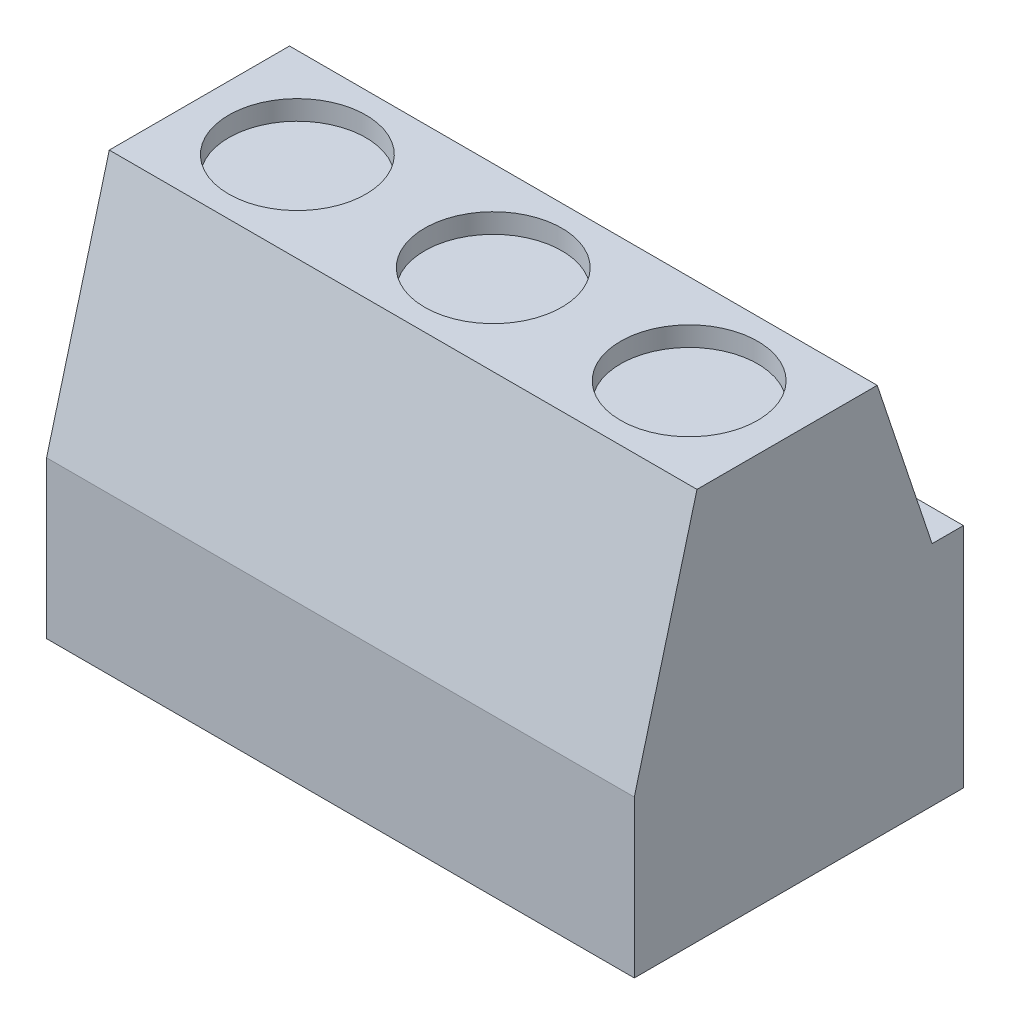
ISO-10303-21;
HEADER;
FILE_DESCRIPTION(('STEP AP214'),'2;1');
FILE_NAME('part.step','',(''),(''),'','','');
FILE_SCHEMA(('AUTOMOTIVE_DESIGN { 1 0 10303 214 1 1 1 1 }'));
ENDSEC;
DATA;
#1=APPLICATION_CONTEXT('core data for automotive mechanical design processes');
#2=APPLICATION_PROTOCOL_DEFINITION('international standard','automotive_design',2000,#1);
#3=PRODUCT_CONTEXT('',#1,'mechanical');
#4=PRODUCT('Part','Part','',(#3));
#5=PRODUCT_RELATED_PRODUCT_CATEGORY('part','',(#4));
#6=PRODUCT_DEFINITION_FORMATION('','',#4);
#7=PRODUCT_DEFINITION_CONTEXT('part definition',#1,'design');
#8=PRODUCT_DEFINITION('design','',#6,#7);
#9=PRODUCT_DEFINITION_SHAPE('','',#8);
#10=(LENGTH_UNIT() NAMED_UNIT(*) SI_UNIT(.MILLI.,.METRE.));
#11=(NAMED_UNIT(*) PLANE_ANGLE_UNIT() SI_UNIT($,.RADIAN.));
#12=(NAMED_UNIT(*) SI_UNIT($,.STERADIAN.) SOLID_ANGLE_UNIT());
#13=UNCERTAINTY_MEASURE_WITH_UNIT(LENGTH_MEASURE(1.E-05),#10,'distance_accuracy_value','');
#14=(GEOMETRIC_REPRESENTATION_CONTEXT(3) GLOBAL_UNCERTAINTY_ASSIGNED_CONTEXT((#13)) GLOBAL_UNIT_ASSIGNED_CONTEXT((#10,
#11,#12)) REPRESENTATION_CONTEXT('',''));
#15=CARTESIAN_POINT('',(0.,0.,0.));
#16=DIRECTION('',(0.,0.,1.));
#17=DIRECTION('',(1.,0.,0.));
#18=AXIS2_PLACEMENT_3D('',#15,#16,#17);
#19=CARTESIAN_POINT('',(-7.5,10.,-4.2));
#20=DIRECTION('',(1.,0.,0.));
#21=DIRECTION('',(0.,0.,-1.));
#22=AXIS2_PLACEMENT_3D('',#19,#20,#21);
#23=PLANE('',#22);
#24=DIRECTION('',(0.,0.,1.));
#25=VECTOR('',#24,1.);
#26=CARTESIAN_POINT('',(-7.5,10.,-4.2));
#27=LINE('',#26,#25);
#28=CARTESIAN_POINT('',(-7.5,10.,-2.));
#29=VERTEX_POINT('',#28);
#30=CARTESIAN_POINT('',(-7.5,10.,2.6));
#31=VERTEX_POINT('',#30);
#32=EDGE_CURVE('E310',#29,#31,#27,.T.);
#33=ORIENTED_EDGE('',*,*,#32,.F.);
#34=DIRECTION('',(0.,0.948683298050514,0.316227766016838));
#35=VECTOR('',#34,1.);
#36=CARTESIAN_POINT('',(-7.5,5.8,-3.4));
#37=LINE('',#36,#35);
#38=CARTESIAN_POINT('',(-7.5,5.8,-3.4));
#39=VERTEX_POINT('',#38);
#40=EDGE_CURVE('E286',#39,#29,#37,.T.);
#41=ORIENTED_EDGE('',*,*,#40,.F.);
#42=DIRECTION('',(0.,0.,1.));
#43=VECTOR('',#42,1.);
#44=CARTESIAN_POINT('',(-7.5,5.8,-3.4));
#45=LINE('',#44,#43);
#46=CARTESIAN_POINT('',(-7.5,5.8,-4.2));
#47=VERTEX_POINT('',#46);
#48=EDGE_CURVE('E290',#47,#39,#45,.T.);
#49=ORIENTED_EDGE('',*,*,#48,.F.);
#50=DIRECTION('',(0.,-1.,0.));
#51=VECTOR('',#50,1.);
#52=CARTESIAN_POINT('',(-7.5,10.,-4.2));
#53=LINE('',#52,#51);
#54=CARTESIAN_POINT('',(-7.5,0.,-4.2));
#55=VERTEX_POINT('',#54);
#56=EDGE_CURVE('E317',#47,#55,#53,.T.);
#57=ORIENTED_EDGE('',*,*,#56,.T.);
#58=DIRECTION('',(0.,0.,1.));
#59=VECTOR('',#58,1.);
#60=CARTESIAN_POINT('',(-7.5,0.,-4.2));
#61=LINE('',#60,#59);
#62=CARTESIAN_POINT('',(-7.5,0.,4.20000000000001));
#63=VERTEX_POINT('',#62);
#64=EDGE_CURVE('E298',#55,#63,#61,.T.);
#65=ORIENTED_EDGE('',*,*,#64,.T.);
#66=DIRECTION('',(0.,-1.,0.));
#67=VECTOR('',#66,1.);
#68=CARTESIAN_POINT('',(-7.5,10.,4.20000000000001));
#69=LINE('',#68,#67);
#70=CARTESIAN_POINT('',(-7.5,4.,4.20000000000001));
#71=VERTEX_POINT('',#70);
#72=EDGE_CURVE('E11',#71,#63,#69,.T.);
#73=ORIENTED_EDGE('',*,*,#72,.F.);
#74=DIRECTION('',(0.,-0.966234939601246,0.257662650560332));
#75=VECTOR('',#74,1.);
#76=CARTESIAN_POINT('',(-7.5,10.,2.6));
#77=LINE('',#76,#75);
#78=EDGE_CURVE('E279',#31,#71,#77,.T.);
#79=ORIENTED_EDGE('',*,*,#78,.F.);
#80=EDGE_LOOP('',(#33,#41,#49,#57,#65,#73,#79));
#81=FACE_BOUND('',#80,.T.);
#82=ADVANCED_FACE('F34',(#81),#23,.F.);
#83=CARTESIAN_POINT('',(-7.5,10.,4.20000000000001));
#84=DIRECTION('',(0.,0.,-1.));
#85=DIRECTION('',(-1.,0.,0.));
#86=AXIS2_PLACEMENT_3D('',#83,#84,#85);
#87=PLANE('',#86);
#88=DIRECTION('',(0.,-1.,0.));
#89=VECTOR('',#88,1.);
#90=CARTESIAN_POINT('',(7.5,10.,4.2));
#91=LINE('',#90,#89);
#92=CARTESIAN_POINT('',(7.5,4.,4.20000000000001));
#93=VERTEX_POINT('',#92);
#94=CARTESIAN_POINT('',(7.5,0.,4.2));
#95=VERTEX_POINT('',#94);
#96=EDGE_CURVE('E41',#93,#95,#91,.T.);
#97=ORIENTED_EDGE('',*,*,#96,.F.);
#98=DIRECTION('',(-1.,0.,0.));
#99=VECTOR('',#98,1.);
#100=CARTESIAN_POINT('',(7.5,4.,4.20000000000001));
#101=LINE('',#100,#99);
#102=EDGE_CURVE('E293',#93,#71,#101,.T.);
#103=ORIENTED_EDGE('',*,*,#102,.T.);
#104=ORIENTED_EDGE('',*,*,#72,.T.);
#105=DIRECTION('',(1.,0.,0.));
#106=VECTOR('',#105,1.);
#107=CARTESIAN_POINT('',(-7.5,0.,4.20000000000001));
#108=LINE('',#107,#106);
#109=EDGE_CURVE('E320',#63,#95,#108,.T.);
#110=ORIENTED_EDGE('',*,*,#109,.T.);
#111=EDGE_LOOP('',(#97,#103,#104,#110));
#112=FACE_BOUND('',#111,.T.);
#113=ADVANCED_FACE('F339',(#112),#87,.F.);
#114=CARTESIAN_POINT('',(7.5,10.,-4.2));
#115=DIRECTION('',(-1.,0.,0.));
#116=DIRECTION('',(0.,0.,1.));
#117=AXIS2_PLACEMENT_3D('',#114,#115,#116);
#118=PLANE('',#117);
#119=DIRECTION('',(0.,0.,1.));
#120=VECTOR('',#119,1.);
#121=CARTESIAN_POINT('',(7.5,5.8,-3.4));
#122=LINE('',#121,#120);
#123=CARTESIAN_POINT('',(7.5,5.8,-4.2));
#124=VERTEX_POINT('',#123);
#125=CARTESIAN_POINT('',(7.5,5.8,-3.4));
#126=VERTEX_POINT('',#125);
#127=EDGE_CURVE('E282',#124,#126,#122,.T.);
#128=ORIENTED_EDGE('',*,*,#127,.T.);
#129=DIRECTION('',(0.,0.948683298050514,0.316227766016838));
#130=VECTOR('',#129,1.);
#131=CARTESIAN_POINT('',(7.5,5.8,-3.4));
#132=LINE('',#131,#130);
#133=CARTESIAN_POINT('',(7.5,10.,-2.));
#134=VERTEX_POINT('',#133);
#135=EDGE_CURVE('E285',#126,#134,#132,.T.);
#136=ORIENTED_EDGE('',*,*,#135,.T.);
#137=DIRECTION('',(0.,0.,-1.));
#138=VECTOR('',#137,1.);
#139=CARTESIAN_POINT('',(7.5,10.,-4.2));
#140=LINE('',#139,#138);
#141=CARTESIAN_POINT('',(7.5,10.,2.6));
#142=VERTEX_POINT('',#141);
#143=EDGE_CURVE('E313',#142,#134,#140,.T.);
#144=ORIENTED_EDGE('',*,*,#143,.F.);
#145=DIRECTION('',(0.,-0.966234939601246,0.257662650560332));
#146=VECTOR('',#145,1.);
#147=CARTESIAN_POINT('',(7.5,10.,2.6));
#148=LINE('',#147,#146);
#149=EDGE_CURVE('E302',#142,#93,#148,.T.);
#150=ORIENTED_EDGE('',*,*,#149,.T.);
#151=ORIENTED_EDGE('',*,*,#96,.T.);
#152=DIRECTION('',(0.,0.,-1.));
#153=VECTOR('',#152,1.);
#154=CARTESIAN_POINT('',(7.5,0.,-4.2));
#155=LINE('',#154,#153);
#156=CARTESIAN_POINT('',(7.5,0.,-4.2));
#157=VERTEX_POINT('',#156);
#158=EDGE_CURVE('E323',#95,#157,#155,.T.);
#159=ORIENTED_EDGE('',*,*,#158,.T.);
#160=DIRECTION('',(0.,-1.,0.));
#161=VECTOR('',#160,1.);
#162=CARTESIAN_POINT('',(7.5,10.,-4.2));
#163=LINE('',#162,#161);
#164=EDGE_CURVE('E329',#124,#157,#163,.T.);
#165=ORIENTED_EDGE('',*,*,#164,.F.);
#166=EDGE_LOOP('',(#128,#136,#144,#150,#151,#159,#165));
#167=FACE_BOUND('',#166,.T.);
#168=ADVANCED_FACE('F332',(#167),#118,.F.);
#169=CARTESIAN_POINT('',(-7.5,10.,-4.2));
#170=DIRECTION('',(0.,0.,1.));
#171=DIRECTION('',(1.,0.,0.));
#172=AXIS2_PLACEMENT_3D('',#169,#170,#171);
#173=PLANE('',#172);
#174=DIRECTION('',(-1.,0.,0.));
#175=VECTOR('',#174,1.);
#176=CARTESIAN_POINT('',(1.5,1.4,-4.2));
#177=LINE('',#176,#175);
#178=CARTESIAN_POINT('',(1.5,1.4,-4.2));
#179=VERTEX_POINT('',#178);
#180=CARTESIAN_POINT('',(-1.5,1.4,-4.2));
#181=VERTEX_POINT('',#180);
#182=EDGE_CURVE('E192',#179,#181,#177,.T.);
#183=ORIENTED_EDGE('',*,*,#182,.F.);
#184=DIRECTION('',(0.,-1.,0.));
#185=VECTOR('',#184,1.);
#186=CARTESIAN_POINT('',(1.5,3.4,-4.2));
#187=LINE('',#186,#185);
#188=CARTESIAN_POINT('',(1.5,3.4,-4.2));
#189=VERTEX_POINT('',#188);
#190=EDGE_CURVE('E48',#189,#179,#187,.T.);
#191=ORIENTED_EDGE('',*,*,#190,.F.);
#192=DIRECTION('',(1.,0.,0.));
#193=VECTOR('',#192,1.);
#194=CARTESIAN_POINT('',(1.5,3.4,-4.2));
#195=LINE('',#194,#193);
#196=CARTESIAN_POINT('',(-1.5,3.4,-4.2));
#197=VERTEX_POINT('',#196);
#198=EDGE_CURVE('E183',#197,#189,#195,.T.);
#199=ORIENTED_EDGE('',*,*,#198,.F.);
#200=DIRECTION('',(0.,1.,0.));
#201=VECTOR('',#200,1.);
#202=CARTESIAN_POINT('',(-1.5,3.4,-4.2));
#203=LINE('',#202,#201);
#204=EDGE_CURVE('E186',#181,#197,#203,.T.);
#205=ORIENTED_EDGE('',*,*,#204,.F.);
#206=EDGE_LOOP('',(#183,#191,#199,#205));
#207=FACE_BOUND('',#206,.T.);
#208=DIRECTION('',(-1.,0.,0.));
#209=VECTOR('',#208,1.);
#210=CARTESIAN_POINT('',(6.5,1.4,-4.2));
#211=LINE('',#210,#209);
#212=CARTESIAN_POINT('',(6.5,1.4,-4.2));
#213=VERTEX_POINT('',#212);
#214=CARTESIAN_POINT('',(3.5,1.4,-4.2));
#215=VERTEX_POINT('',#214);
#216=EDGE_CURVE('E218',#213,#215,#211,.T.);
#217=ORIENTED_EDGE('',*,*,#216,.F.);
#218=DIRECTION('',(0.,-1.,0.));
#219=VECTOR('',#218,1.);
#220=CARTESIAN_POINT('',(6.5,3.4,-4.2));
#221=LINE('',#220,#219);
#222=CARTESIAN_POINT('',(6.5,3.4,-4.2));
#223=VERTEX_POINT('',#222);
#224=EDGE_CURVE('E56',#223,#213,#221,.T.);
#225=ORIENTED_EDGE('',*,*,#224,.F.);
#226=DIRECTION('',(1.,0.,0.));
#227=VECTOR('',#226,1.);
#228=CARTESIAN_POINT('',(6.5,3.4,-4.2));
#229=LINE('',#228,#227);
#230=CARTESIAN_POINT('',(3.5,3.4,-4.2));
#231=VERTEX_POINT('',#230);
#232=EDGE_CURVE('E207',#231,#223,#229,.T.);
#233=ORIENTED_EDGE('',*,*,#232,.F.);
#234=DIRECTION('',(0.,1.,0.));
#235=VECTOR('',#234,1.);
#236=CARTESIAN_POINT('',(3.5,3.4,-4.2));
#237=LINE('',#236,#235);
#238=EDGE_CURVE('E221',#215,#231,#237,.T.);
#239=ORIENTED_EDGE('',*,*,#238,.F.);
#240=EDGE_LOOP('',(#217,#225,#233,#239));
#241=FACE_BOUND('',#240,.T.);
#242=DIRECTION('',(-1.,0.,0.));
#243=VECTOR('',#242,1.);
#244=CARTESIAN_POINT('',(-3.5,1.4,-4.2));
#245=LINE('',#244,#243);
#246=CARTESIAN_POINT('',(-3.5,1.4,-4.2));
#247=VERTEX_POINT('',#246);
#248=CARTESIAN_POINT('',(-6.5,1.4,-4.2));
#249=VERTEX_POINT('',#248);
#250=EDGE_CURVE('E259',#247,#249,#245,.T.);
#251=ORIENTED_EDGE('',*,*,#250,.F.);
#252=DIRECTION('',(0.,-1.,0.));
#253=VECTOR('',#252,1.);
#254=CARTESIAN_POINT('',(-3.5,3.4,-4.2));
#255=LINE('',#254,#253);
#256=CARTESIAN_POINT('',(-3.5,3.4,-4.2));
#257=VERTEX_POINT('',#256);
#258=EDGE_CURVE('E239',#257,#247,#255,.T.);
#259=ORIENTED_EDGE('',*,*,#258,.F.);
#260=DIRECTION('',(1.,0.,0.));
#261=VECTOR('',#260,1.);
#262=CARTESIAN_POINT('',(-3.5,3.4,-4.2));
#263=LINE('',#262,#261);
#264=CARTESIAN_POINT('',(-6.5,3.4,-4.2));
#265=VERTEX_POINT('',#264);
#266=EDGE_CURVE('E248',#265,#257,#263,.T.);
#267=ORIENTED_EDGE('',*,*,#266,.F.);
#268=DIRECTION('',(0.,1.,0.));
#269=VECTOR('',#268,1.);
#270=CARTESIAN_POINT('',(-6.5,3.4,-4.2));
#271=LINE('',#270,#269);
#272=EDGE_CURVE('E262',#249,#265,#271,.T.);
#273=ORIENTED_EDGE('',*,*,#272,.F.);
#274=EDGE_LOOP('',(#251,#259,#267,#273));
#275=FACE_BOUND('',#274,.T.);
#276=ORIENTED_EDGE('',*,*,#56,.F.);
#277=DIRECTION('',(-1.,0.,0.));
#278=VECTOR('',#277,1.);
#279=CARTESIAN_POINT('',(7.5,5.8,-4.2));
#280=LINE('',#279,#278);
#281=EDGE_CURVE('E289',#124,#47,#280,.T.);
#282=ORIENTED_EDGE('',*,*,#281,.F.);
#283=ORIENTED_EDGE('',*,*,#164,.T.);
#284=DIRECTION('',(-1.,0.,0.));
#285=VECTOR('',#284,1.);
#286=CARTESIAN_POINT('',(-7.5,0.,-4.2));
#287=LINE('',#286,#285);
#288=EDGE_CURVE('E314',#157,#55,#287,.T.);
#289=ORIENTED_EDGE('',*,*,#288,.T.);
#290=EDGE_LOOP('',(#276,#282,#283,#289));
#291=FACE_BOUND('',#290,.T.);
#292=ADVANCED_FACE('F346',(#207,#241,#275,#291),#173,.F.);
#293=CARTESIAN_POINT('',(0.,10.,0.));
#294=DIRECTION('',(0.,1.,0.));
#295=DIRECTION('',(0.,0.,1.));
#296=AXIS2_PLACEMENT_3D('',#293,#294,#295);
#297=PLANE('',#296);
#298=CARTESIAN_POINT('',(0.,10.,0.300000000000004));
#299=DIRECTION('',(0.,1.,0.));
#300=DIRECTION('',(0.,0.,1.));
#301=AXIS2_PLACEMENT_3D('',#298,#299,#300);
#302=CIRCLE('',#301,1.75);
#303=CARTESIAN_POINT('',(0.,10.,2.05000000000001));
#304=VERTEX_POINT('',#303);
#305=EDGE_CURVE('E232',#304,#304,#302,.T.);
#306=ORIENTED_EDGE('',*,*,#305,.F.);
#307=EDGE_LOOP('',(#306));
#308=FACE_BOUND('',#307,.T.);
#309=CARTESIAN_POINT('',(5.,10.,0.300000000000002));
#310=DIRECTION('',(0.,1.,0.));
#311=DIRECTION('',(0.,0.,1.));
#312=AXIS2_PLACEMENT_3D('',#309,#310,#311);
#313=CIRCLE('',#312,1.75);
#314=CARTESIAN_POINT('',(5.,10.,2.05000000000001));
#315=VERTEX_POINT('',#314);
#316=EDGE_CURVE('E199',#315,#315,#313,.T.);
#317=ORIENTED_EDGE('',*,*,#316,.F.);
#318=EDGE_LOOP('',(#317));
#319=FACE_BOUND('',#318,.T.);
#320=CARTESIAN_POINT('',(-5.,10.,0.300000000000005));
#321=DIRECTION('',(0.,1.,0.));
#322=DIRECTION('',(0.,0.,1.));
#323=AXIS2_PLACEMENT_3D('',#320,#321,#322);
#324=CIRCLE('',#323,1.75);
#325=CARTESIAN_POINT('',(-5.,10.,2.05000000000001));
#326=VERTEX_POINT('',#325);
#327=EDGE_CURVE('E269',#326,#326,#324,.T.);
#328=ORIENTED_EDGE('',*,*,#327,.F.);
#329=EDGE_LOOP('',(#328));
#330=FACE_BOUND('',#329,.T.);
#331=DIRECTION('',(-1.,0.,0.));
#332=VECTOR('',#331,1.);
#333=CARTESIAN_POINT('',(7.5,10.,-2.));
#334=LINE('',#333,#332);
#335=EDGE_CURVE('E295',#134,#29,#334,.T.);
#336=ORIENTED_EDGE('',*,*,#335,.T.);
#337=ORIENTED_EDGE('',*,*,#32,.T.);
#338=DIRECTION('',(-1.,0.,0.));
#339=VECTOR('',#338,1.);
#340=CARTESIAN_POINT('',(7.5,10.,2.6));
#341=LINE('',#340,#339);
#342=EDGE_CURVE('E305',#142,#31,#341,.T.);
#343=ORIENTED_EDGE('',*,*,#342,.F.);
#344=ORIENTED_EDGE('',*,*,#143,.T.);
#345=EDGE_LOOP('',(#336,#337,#343,#344));
#346=FACE_BOUND('',#345,.T.);
#347=ADVANCED_FACE('F357',(#308,#319,#330,#346),#297,.T.);
#348=CARTESIAN_POINT('',(0.,0.,0.));
#349=DIRECTION('',(0.,1.,0.));
#350=DIRECTION('',(0.,0.,1.));
#351=AXIS2_PLACEMENT_3D('',#348,#349,#350);
#352=PLANE('',#351);
#353=ORIENTED_EDGE('',*,*,#64,.F.);
#354=ORIENTED_EDGE('',*,*,#288,.F.);
#355=ORIENTED_EDGE('',*,*,#158,.F.);
#356=ORIENTED_EDGE('',*,*,#109,.F.);
#357=EDGE_LOOP('',(#353,#354,#355,#356));
#358=FACE_BOUND('',#357,.T.);
#359=ADVANCED_FACE('F343',(#358),#352,.F.);
#360=CARTESIAN_POINT('',(7.5,10.,2.6));
#361=DIRECTION('',(0.,-0.257662650560332,-0.966234939601246));
#362=DIRECTION('',(0.,0.966234939601246,-0.257662650560332));
#363=AXIS2_PLACEMENT_3D('',#360,#361,#362);
#364=PLANE('',#363);
#365=ORIENTED_EDGE('',*,*,#78,.T.);
#366=ORIENTED_EDGE('',*,*,#102,.F.);
#367=ORIENTED_EDGE('',*,*,#149,.F.);
#368=ORIENTED_EDGE('',*,*,#342,.T.);
#369=EDGE_LOOP('',(#365,#366,#367,#368));
#370=FACE_BOUND('',#369,.T.);
#371=ADVANCED_FACE('F362',(#370),#364,.F.);
#372=CARTESIAN_POINT('',(7.5,5.8,-3.4));
#373=DIRECTION('',(0.,-0.316227766016838,0.948683298050514));
#374=DIRECTION('',(0.,-0.948683298050514,-0.316227766016838));
#375=AXIS2_PLACEMENT_3D('',#372,#373,#374);
#376=PLANE('',#375);
#377=ORIENTED_EDGE('',*,*,#40,.T.);
#378=ORIENTED_EDGE('',*,*,#335,.F.);
#379=ORIENTED_EDGE('',*,*,#135,.F.);
#380=DIRECTION('',(-1.,0.,0.));
#381=VECTOR('',#380,1.);
#382=CARTESIAN_POINT('',(7.5,5.8,-3.4));
#383=LINE('',#382,#381);
#384=EDGE_CURVE('E299',#126,#39,#383,.T.);
#385=ORIENTED_EDGE('',*,*,#384,.T.);
#386=EDGE_LOOP('',(#377,#378,#379,#385));
#387=FACE_BOUND('',#386,.T.);
#388=ADVANCED_FACE('F354',(#387),#376,.F.);
#389=CARTESIAN_POINT('',(7.5,5.8,-3.4));
#390=DIRECTION('',(0.,-1.,0.));
#391=DIRECTION('',(0.,0.,-1.));
#392=AXIS2_PLACEMENT_3D('',#389,#390,#391);
#393=PLANE('',#392);
#394=ORIENTED_EDGE('',*,*,#48,.T.);
#395=ORIENTED_EDGE('',*,*,#384,.F.);
#396=ORIENTED_EDGE('',*,*,#127,.F.);
#397=ORIENTED_EDGE('',*,*,#281,.T.);
#398=EDGE_LOOP('',(#394,#395,#396,#397));
#399=FACE_BOUND('',#398,.T.);
#400=ADVANCED_FACE('F350',(#399),#393,.F.);
#401=CARTESIAN_POINT('',(-5.,9.5,0.300000000000005));
#402=DIRECTION('',(0.,1.,0.));
#403=DIRECTION('',(0.,0.,1.));
#404=AXIS2_PLACEMENT_3D('',#401,#402,#403);
#405=CYLINDRICAL_SURFACE('',#404,1.75);
#406=CARTESIAN_POINT('',(-5.,9.5,0.300000000000005));
#407=DIRECTION('',(0.,1.,0.));
#408=DIRECTION('',(0.,0.,1.));
#409=AXIS2_PLACEMENT_3D('',#406,#407,#408);
#410=CIRCLE('',#409,1.75);
#411=CARTESIAN_POINT('',(-5.,9.5,2.05000000000001));
#412=VERTEX_POINT('',#411);
#413=EDGE_CURVE('E276',#412,#412,#410,.T.);
#414=ORIENTED_EDGE('',*,*,#413,.F.);
#415=EDGE_LOOP('',(#414));
#416=FACE_BOUND('',#415,.T.);
#417=ORIENTED_EDGE('',*,*,#327,.T.);
#418=EDGE_LOOP('',(#417));
#419=FACE_BOUND('',#418,.T.);
#420=ADVANCED_FACE('F394',(#416,#419),#405,.F.);
#421=CARTESIAN_POINT('',(-5.,9.5,0.300000000000005));
#422=DIRECTION('',(0.,1.,0.));
#423=DIRECTION('',(0.,0.,1.));
#424=AXIS2_PLACEMENT_3D('',#421,#422,#423);
#425=PLANE('',#424);
#426=ORIENTED_EDGE('',*,*,#413,.T.);
#427=EDGE_LOOP('',(#426));
#428=FACE_BOUND('',#427,.T.);
#429=ADVANCED_FACE('F396',(#428),#425,.T.);
#430=CARTESIAN_POINT('',(-3.5,3.4,-3.7));
#431=DIRECTION('',(1.,0.,0.));
#432=DIRECTION('',(0.,1.,0.));
#433=AXIS2_PLACEMENT_3D('',#430,#431,#432);
#434=PLANE('',#433);
#435=ORIENTED_EDGE('',*,*,#258,.T.);
#436=DIRECTION('',(0.,0.,-1.));
#437=VECTOR('',#436,1.);
#438=CARTESIAN_POINT('',(-3.5,1.4,-3.7));
#439=LINE('',#438,#437);
#440=CARTESIAN_POINT('',(-3.5,1.4,-3.7));
#441=VERTEX_POINT('',#440);
#442=EDGE_CURVE('E257',#441,#247,#439,.T.);
#443=ORIENTED_EDGE('',*,*,#442,.F.);
#444=DIRECTION('',(0.,-1.,0.));
#445=VECTOR('',#444,1.);
#446=CARTESIAN_POINT('',(-3.5,3.4,-3.7));
#447=LINE('',#446,#445);
#448=CARTESIAN_POINT('',(-3.5,3.4,-3.7));
#449=VERTEX_POINT('',#448);
#450=EDGE_CURVE('E244',#449,#441,#447,.T.);
#451=ORIENTED_EDGE('',*,*,#450,.F.);
#452=DIRECTION('',(0.,0.,-1.));
#453=VECTOR('',#452,1.);
#454=CARTESIAN_POINT('',(-3.5,3.4,-3.7));
#455=LINE('',#454,#453);
#456=EDGE_CURVE('E267',#449,#257,#455,.T.);
#457=ORIENTED_EDGE('',*,*,#456,.T.);
#458=EDGE_LOOP('',(#435,#443,#451,#457));
#459=FACE_BOUND('',#458,.T.);
#460=ADVANCED_FACE('F403',(#459),#434,.F.);
#461=CARTESIAN_POINT('',(-3.5,3.4,-3.7));
#462=DIRECTION('',(0.,1.,0.));
#463=DIRECTION('',(-1.,0.,0.));
#464=AXIS2_PLACEMENT_3D('',#461,#462,#463);
#465=PLANE('',#464);
#466=ORIENTED_EDGE('',*,*,#266,.T.);
#467=ORIENTED_EDGE('',*,*,#456,.F.);
#468=DIRECTION('',(1.,0.,0.));
#469=VECTOR('',#468,1.);
#470=CARTESIAN_POINT('',(-3.5,3.4,-3.7));
#471=LINE('',#470,#469);
#472=CARTESIAN_POINT('',(-6.5,3.4,-3.7));
#473=VERTEX_POINT('',#472);
#474=EDGE_CURVE('E254',#473,#449,#471,.T.);
#475=ORIENTED_EDGE('',*,*,#474,.F.);
#476=DIRECTION('',(0.,0.,-1.));
#477=VECTOR('',#476,1.);
#478=CARTESIAN_POINT('',(-6.5,3.4,-3.7));
#479=LINE('',#478,#477);
#480=EDGE_CURVE('E270',#473,#265,#479,.T.);
#481=ORIENTED_EDGE('',*,*,#480,.T.);
#482=EDGE_LOOP('',(#466,#467,#475,#481));
#483=FACE_BOUND('',#482,.T.);
#484=ADVANCED_FACE('F410',(#483),#465,.F.);
#485=CARTESIAN_POINT('',(-6.5,3.4,-3.7));
#486=DIRECTION('',(-1.,0.,0.));
#487=DIRECTION('',(0.,0.,1.));
#488=AXIS2_PLACEMENT_3D('',#485,#486,#487);
#489=PLANE('',#488);
#490=ORIENTED_EDGE('',*,*,#272,.T.);
#491=ORIENTED_EDGE('',*,*,#480,.F.);
#492=DIRECTION('',(0.,1.,0.));
#493=VECTOR('',#492,1.);
#494=CARTESIAN_POINT('',(-6.5,3.4,-3.7));
#495=LINE('',#494,#493);
#496=CARTESIAN_POINT('',(-6.5,1.4,-3.7));
#497=VERTEX_POINT('',#496);
#498=EDGE_CURVE('E251',#497,#473,#495,.T.);
#499=ORIENTED_EDGE('',*,*,#498,.F.);
#500=DIRECTION('',(0.,0.,-1.));
#501=VECTOR('',#500,1.);
#502=CARTESIAN_POINT('',(-6.5,1.4,-3.7));
#503=LINE('',#502,#501);
#504=EDGE_CURVE('E272',#497,#249,#503,.T.);
#505=ORIENTED_EDGE('',*,*,#504,.T.);
#506=EDGE_LOOP('',(#490,#491,#499,#505));
#507=FACE_BOUND('',#506,.T.);
#508=ADVANCED_FACE('F416',(#507),#489,.F.);
#509=CARTESIAN_POINT('',(-3.5,1.4,-3.7));
#510=DIRECTION('',(0.,-1.,0.));
#511=DIRECTION('',(1.,0.,0.));
#512=AXIS2_PLACEMENT_3D('',#509,#510,#511);
#513=PLANE('',#512);
#514=ORIENTED_EDGE('',*,*,#250,.T.);
#515=ORIENTED_EDGE('',*,*,#504,.F.);
#516=DIRECTION('',(-1.,0.,0.));
#517=VECTOR('',#516,1.);
#518=CARTESIAN_POINT('',(-3.5,1.4,-3.7));
#519=LINE('',#518,#517);
#520=EDGE_CURVE('E247',#441,#497,#519,.T.);
#521=ORIENTED_EDGE('',*,*,#520,.F.);
#522=ORIENTED_EDGE('',*,*,#442,.T.);
#523=EDGE_LOOP('',(#514,#515,#521,#522));
#524=FACE_BOUND('',#523,.T.);
#525=ADVANCED_FACE('F412',(#524),#513,.F.);
#526=CARTESIAN_POINT('',(0.,0.,-3.7));
#527=DIRECTION('',(0.,0.,-1.));
#528=DIRECTION('',(-1.,0.,0.));
#529=AXIS2_PLACEMENT_3D('',#526,#527,#528);
#530=PLANE('',#529);
#531=ORIENTED_EDGE('',*,*,#450,.T.);
#532=ORIENTED_EDGE('',*,*,#520,.T.);
#533=ORIENTED_EDGE('',*,*,#498,.T.);
#534=ORIENTED_EDGE('',*,*,#474,.T.);
#535=EDGE_LOOP('',(#531,#532,#533,#534));
#536=FACE_BOUND('',#535,.T.);
#537=ADVANCED_FACE('F415',(#536),#530,.T.);
#538=CARTESIAN_POINT('',(5.,9.5,0.300000000000002));
#539=DIRECTION('',(0.,1.,0.));
#540=DIRECTION('',(0.,0.,1.));
#541=AXIS2_PLACEMENT_3D('',#538,#539,#540);
#542=CYLINDRICAL_SURFACE('',#541,1.75);
#543=CARTESIAN_POINT('',(5.,9.5,0.300000000000002));
#544=DIRECTION('',(0.,1.,0.));
#545=DIRECTION('',(0.,0.,1.));
#546=AXIS2_PLACEMENT_3D('',#543,#544,#545);
#547=CIRCLE('',#546,1.75);
#548=CARTESIAN_POINT('',(5.,9.5,2.05000000000001));
#549=VERTEX_POINT('',#548);
#550=EDGE_CURVE('E236',#549,#549,#547,.T.);
#551=ORIENTED_EDGE('',*,*,#550,.F.);
#552=EDGE_LOOP('',(#551));
#553=FACE_BOUND('',#552,.T.);
#554=ORIENTED_EDGE('',*,*,#316,.T.);
#555=EDGE_LOOP('',(#554));
#556=FACE_BOUND('',#555,.T.);
#557=ADVANCED_FACE('F426',(#553,#556),#542,.F.);
#558=CARTESIAN_POINT('',(5.,9.5,0.300000000000002));
#559=DIRECTION('',(0.,1.,0.));
#560=DIRECTION('',(0.,0.,1.));
#561=AXIS2_PLACEMENT_3D('',#558,#559,#560);
#562=PLANE('',#561);
#563=ORIENTED_EDGE('',*,*,#550,.T.);
#564=EDGE_LOOP('',(#563));
#565=FACE_BOUND('',#564,.T.);
#566=ADVANCED_FACE('F430',(#565),#562,.T.);
#567=CARTESIAN_POINT('',(0.,9.5,0.300000000000004));
#568=DIRECTION('',(0.,1.,0.));
#569=DIRECTION('',(0.,0.,1.));
#570=AXIS2_PLACEMENT_3D('',#567,#568,#569);
#571=CYLINDRICAL_SURFACE('',#570,1.75);
#572=CARTESIAN_POINT('',(0.,9.5,0.300000000000004));
#573=DIRECTION('',(0.,1.,0.));
#574=DIRECTION('',(0.,0.,1.));
#575=AXIS2_PLACEMENT_3D('',#572,#573,#574);
#576=CIRCLE('',#575,1.75);
#577=CARTESIAN_POINT('',(0.,9.5,2.05000000000001));
#578=VERTEX_POINT('',#577);
#579=EDGE_CURVE('E235',#578,#578,#576,.T.);
#580=ORIENTED_EDGE('',*,*,#579,.F.);
#581=EDGE_LOOP('',(#580));
#582=FACE_BOUND('',#581,.T.);
#583=ORIENTED_EDGE('',*,*,#305,.T.);
#584=EDGE_LOOP('',(#583));
#585=FACE_BOUND('',#584,.T.);
#586=ADVANCED_FACE('F434',(#582,#585),#571,.F.);
#587=CARTESIAN_POINT('',(0.,9.5,0.300000000000004));
#588=DIRECTION('',(0.,1.,0.));
#589=DIRECTION('',(0.,0.,1.));
#590=AXIS2_PLACEMENT_3D('',#587,#588,#589);
#591=PLANE('',#590);
#592=ORIENTED_EDGE('',*,*,#579,.T.);
#593=EDGE_LOOP('',(#592));
#594=FACE_BOUND('',#593,.T.);
#595=ADVANCED_FACE('F438',(#594),#591,.T.);
#596=CARTESIAN_POINT('',(6.5,3.4,-3.7));
#597=DIRECTION('',(1.,0.,0.));
#598=DIRECTION('',(0.,1.,0.));
#599=AXIS2_PLACEMENT_3D('',#596,#597,#598);
#600=PLANE('',#599);
#601=ORIENTED_EDGE('',*,*,#224,.T.);
#602=DIRECTION('',(0.,0.,-1.));
#603=VECTOR('',#602,1.);
#604=CARTESIAN_POINT('',(6.5,1.4,-3.7));
#605=LINE('',#604,#603);
#606=CARTESIAN_POINT('',(6.5,1.4,-3.7));
#607=VERTEX_POINT('',#606);
#608=EDGE_CURVE('E216',#607,#213,#605,.T.);
#609=ORIENTED_EDGE('',*,*,#608,.F.);
#610=DIRECTION('',(0.,-1.,0.));
#611=VECTOR('',#610,1.);
#612=CARTESIAN_POINT('',(6.5,3.4,-3.7));
#613=LINE('',#612,#611);
#614=CARTESIAN_POINT('',(6.5,3.4,-3.7));
#615=VERTEX_POINT('',#614);
#616=EDGE_CURVE('E203',#615,#607,#613,.T.);
#617=ORIENTED_EDGE('',*,*,#616,.F.);
#618=DIRECTION('',(0.,0.,-1.));
#619=VECTOR('',#618,1.);
#620=CARTESIAN_POINT('',(6.5,3.4,-3.7));
#621=LINE('',#620,#619);
#622=EDGE_CURVE('E193',#615,#223,#621,.T.);
#623=ORIENTED_EDGE('',*,*,#622,.T.);
#624=EDGE_LOOP('',(#601,#609,#617,#623));
#625=FACE_BOUND('',#624,.T.);
#626=ADVANCED_FACE('F442',(#625),#600,.F.);
#627=CARTESIAN_POINT('',(6.5,3.4,-3.7));
#628=DIRECTION('',(0.,1.,0.));
#629=DIRECTION('',(-1.,0.,0.));
#630=AXIS2_PLACEMENT_3D('',#627,#628,#629);
#631=PLANE('',#630);
#632=ORIENTED_EDGE('',*,*,#232,.T.);
#633=ORIENTED_EDGE('',*,*,#622,.F.);
#634=DIRECTION('',(1.,0.,0.));
#635=VECTOR('',#634,1.);
#636=CARTESIAN_POINT('',(6.5,3.4,-3.7));
#637=LINE('',#636,#635);
#638=CARTESIAN_POINT('',(3.5,3.4,-3.7));
#639=VERTEX_POINT('',#638);
#640=EDGE_CURVE('E213',#639,#615,#637,.T.);
#641=ORIENTED_EDGE('',*,*,#640,.F.);
#642=DIRECTION('',(0.,0.,-1.));
#643=VECTOR('',#642,1.);
#644=CARTESIAN_POINT('',(3.5,3.4,-3.7));
#645=LINE('',#644,#643);
#646=EDGE_CURVE('E227',#639,#231,#645,.T.);
#647=ORIENTED_EDGE('',*,*,#646,.T.);
#648=EDGE_LOOP('',(#632,#633,#641,#647));
#649=FACE_BOUND('',#648,.T.);
#650=ADVANCED_FACE('F446',(#649),#631,.F.);
#651=CARTESIAN_POINT('',(3.5,3.4,-3.7));
#652=DIRECTION('',(-1.,0.,0.));
#653=DIRECTION('',(0.,0.,1.));
#654=AXIS2_PLACEMENT_3D('',#651,#652,#653);
#655=PLANE('',#654);
#656=ORIENTED_EDGE('',*,*,#238,.T.);
#657=ORIENTED_EDGE('',*,*,#646,.F.);
#658=DIRECTION('',(0.,1.,0.));
#659=VECTOR('',#658,1.);
#660=CARTESIAN_POINT('',(3.5,3.4,-3.7));
#661=LINE('',#660,#659);
#662=CARTESIAN_POINT('',(3.5,1.4,-3.7));
#663=VERTEX_POINT('',#662);
#664=EDGE_CURVE('E210',#663,#639,#661,.T.);
#665=ORIENTED_EDGE('',*,*,#664,.F.);
#666=DIRECTION('',(0.,0.,-1.));
#667=VECTOR('',#666,1.);
#668=CARTESIAN_POINT('',(3.5,1.4,-3.7));
#669=LINE('',#668,#667);
#670=EDGE_CURVE('E229',#663,#215,#669,.T.);
#671=ORIENTED_EDGE('',*,*,#670,.T.);
#672=EDGE_LOOP('',(#656,#657,#665,#671));
#673=FACE_BOUND('',#672,.T.);
#674=ADVANCED_FACE('F451',(#673),#655,.F.);
#675=CARTESIAN_POINT('',(6.5,1.4,-3.7));
#676=DIRECTION('',(0.,-1.,0.));
#677=DIRECTION('',(1.,0.,0.));
#678=AXIS2_PLACEMENT_3D('',#675,#676,#677);
#679=PLANE('',#678);
#680=ORIENTED_EDGE('',*,*,#216,.T.);
#681=ORIENTED_EDGE('',*,*,#670,.F.);
#682=DIRECTION('',(-1.,0.,0.));
#683=VECTOR('',#682,1.);
#684=CARTESIAN_POINT('',(6.5,1.4,-3.7));
#685=LINE('',#684,#683);
#686=EDGE_CURVE('E206',#607,#663,#685,.T.);
#687=ORIENTED_EDGE('',*,*,#686,.F.);
#688=ORIENTED_EDGE('',*,*,#608,.T.);
#689=EDGE_LOOP('',(#680,#681,#687,#688));
#690=FACE_BOUND('',#689,.T.);
#691=ADVANCED_FACE('F447',(#690),#679,.F.);
#692=CARTESIAN_POINT('',(10.,0.,-3.7));
#693=DIRECTION('',(0.,0.,-1.));
#694=DIRECTION('',(-1.,0.,0.));
#695=AXIS2_PLACEMENT_3D('',#692,#693,#694);
#696=PLANE('',#695);
#697=ORIENTED_EDGE('',*,*,#616,.T.);
#698=ORIENTED_EDGE('',*,*,#686,.T.);
#699=ORIENTED_EDGE('',*,*,#664,.T.);
#700=ORIENTED_EDGE('',*,*,#640,.T.);
#701=EDGE_LOOP('',(#697,#698,#699,#700));
#702=FACE_BOUND('',#701,.T.);
#703=ADVANCED_FACE('F450',(#702),#696,.T.);
#704=CARTESIAN_POINT('',(1.5,3.4,-3.7));
#705=DIRECTION('',(1.,0.,0.));
#706=DIRECTION('',(0.,1.,0.));
#707=AXIS2_PLACEMENT_3D('',#704,#705,#706);
#708=PLANE('',#707);
#709=ORIENTED_EDGE('',*,*,#190,.T.);
#710=DIRECTION('',(0.,0.,-1.));
#711=VECTOR('',#710,1.);
#712=CARTESIAN_POINT('',(1.5,1.4,-3.7));
#713=LINE('',#712,#711);
#714=CARTESIAN_POINT('',(1.5,1.4,-3.7));
#715=VERTEX_POINT('',#714);
#716=EDGE_CURVE('E161',#715,#179,#713,.T.);
#717=ORIENTED_EDGE('',*,*,#716,.F.);
#718=DIRECTION('',(0.,-1.,0.));
#719=VECTOR('',#718,1.);
#720=CARTESIAN_POINT('',(1.5,3.4,-3.7));
#721=LINE('',#720,#719);
#722=CARTESIAN_POINT('',(1.5,3.4,-3.7));
#723=VERTEX_POINT('',#722);
#724=EDGE_CURVE('E165',#723,#715,#721,.T.);
#725=ORIENTED_EDGE('',*,*,#724,.F.);
#726=DIRECTION('',(0.,0.,-1.));
#727=VECTOR('',#726,1.);
#728=CARTESIAN_POINT('',(1.5,3.4,-3.7));
#729=LINE('',#728,#727);
#730=EDGE_CURVE('E197',#723,#189,#729,.T.);
#731=ORIENTED_EDGE('',*,*,#730,.T.);
#732=EDGE_LOOP('',(#709,#717,#725,#731));
#733=FACE_BOUND('',#732,.T.);
#734=ADVANCED_FACE('F163',(#733),#708,.F.);
#735=CARTESIAN_POINT('',(1.5,3.4,-3.7));
#736=DIRECTION('',(0.,1.,0.));
#737=DIRECTION('',(-1.,0.,0.));
#738=AXIS2_PLACEMENT_3D('',#735,#736,#737);
#739=PLANE('',#738);
#740=ORIENTED_EDGE('',*,*,#198,.T.);
#741=ORIENTED_EDGE('',*,*,#730,.F.);
#742=DIRECTION('',(1.,0.,0.));
#743=VECTOR('',#742,1.);
#744=CARTESIAN_POINT('',(1.5,3.4,-3.7));
#745=LINE('',#744,#743);
#746=CARTESIAN_POINT('',(-1.5,3.4,-3.7));
#747=VERTEX_POINT('',#746);
#748=EDGE_CURVE('E171',#747,#723,#745,.T.);
#749=ORIENTED_EDGE('',*,*,#748,.F.);
#750=DIRECTION('',(0.,0.,-1.));
#751=VECTOR('',#750,1.);
#752=CARTESIAN_POINT('',(-1.5,3.4,-3.7));
#753=LINE('',#752,#751);
#754=EDGE_CURVE('E200',#747,#197,#753,.T.);
#755=ORIENTED_EDGE('',*,*,#754,.T.);
#756=EDGE_LOOP('',(#740,#741,#749,#755));
#757=FACE_BOUND('',#756,.T.);
#758=ADVANCED_FACE('F464',(#757),#739,.F.);
#759=CARTESIAN_POINT('',(-1.5,3.4,-3.7));
#760=DIRECTION('',(-1.,0.,0.));
#761=DIRECTION('',(0.,0.,1.));
#762=AXIS2_PLACEMENT_3D('',#759,#760,#761);
#763=PLANE('',#762);
#764=ORIENTED_EDGE('',*,*,#204,.T.);
#765=ORIENTED_EDGE('',*,*,#754,.F.);
#766=DIRECTION('',(0.,1.,0.));
#767=VECTOR('',#766,1.);
#768=CARTESIAN_POINT('',(-1.5,3.4,-3.7));
#769=LINE('',#768,#767);
#770=CARTESIAN_POINT('',(-1.5,1.4,-3.7));
#771=VERTEX_POINT('',#770);
#772=EDGE_CURVE('E179',#771,#747,#769,.T.);
#773=ORIENTED_EDGE('',*,*,#772,.F.);
#774=DIRECTION('',(0.,0.,-1.));
#775=VECTOR('',#774,1.);
#776=CARTESIAN_POINT('',(-1.5,1.4,-3.7));
#777=LINE('',#776,#775);
#778=EDGE_CURVE('E170',#771,#181,#777,.T.);
#779=ORIENTED_EDGE('',*,*,#778,.T.);
#780=EDGE_LOOP('',(#764,#765,#773,#779));
#781=FACE_BOUND('',#780,.T.);
#782=ADVANCED_FACE('F467',(#781),#763,.F.);
#783=CARTESIAN_POINT('',(1.5,1.4,-3.7));
#784=DIRECTION('',(0.,-1.,0.));
#785=DIRECTION('',(1.,0.,0.));
#786=AXIS2_PLACEMENT_3D('',#783,#784,#785);
#787=PLANE('',#786);
#788=ORIENTED_EDGE('',*,*,#182,.T.);
#789=ORIENTED_EDGE('',*,*,#778,.F.);
#790=DIRECTION('',(-1.,0.,0.));
#791=VECTOR('',#790,1.);
#792=CARTESIAN_POINT('',(1.5,1.4,-3.7));
#793=LINE('',#792,#791);
#794=EDGE_CURVE('E174',#715,#771,#793,.T.);
#795=ORIENTED_EDGE('',*,*,#794,.F.);
#796=ORIENTED_EDGE('',*,*,#716,.T.);
#797=EDGE_LOOP('',(#788,#789,#795,#796));
#798=FACE_BOUND('',#797,.T.);
#799=ADVANCED_FACE('F175',(#798),#787,.F.);
#800=CARTESIAN_POINT('',(5.,0.,-3.7));
#801=DIRECTION('',(0.,0.,-1.));
#802=DIRECTION('',(-1.,0.,0.));
#803=AXIS2_PLACEMENT_3D('',#800,#801,#802);
#804=PLANE('',#803);
#805=ORIENTED_EDGE('',*,*,#724,.T.);
#806=ORIENTED_EDGE('',*,*,#794,.T.);
#807=ORIENTED_EDGE('',*,*,#772,.T.);
#808=ORIENTED_EDGE('',*,*,#748,.T.);
#809=EDGE_LOOP('',(#805,#806,#807,#808));
#810=FACE_BOUND('',#809,.T.);
#811=ADVANCED_FACE('F181',(#810),#804,.T.);
#812=CLOSED_SHELL('',(#82,#113,#168,#292,#347,#359,#371,#388,#400,#420,#429,#460,#484,#508,#525,
#537,#557,#566,#586,#595,#626,#650,#674,#691,#703,#734,#758,#782,#799,#811));
#813=MANIFOLD_SOLID_BREP('B2',#812);
#814=ADVANCED_BREP_SHAPE_REPRESENTATION('',(#18,#813),#14);
#815=SHAPE_DEFINITION_REPRESENTATION(#9,#814);
ENDSEC;
END-ISO-10303-21;
